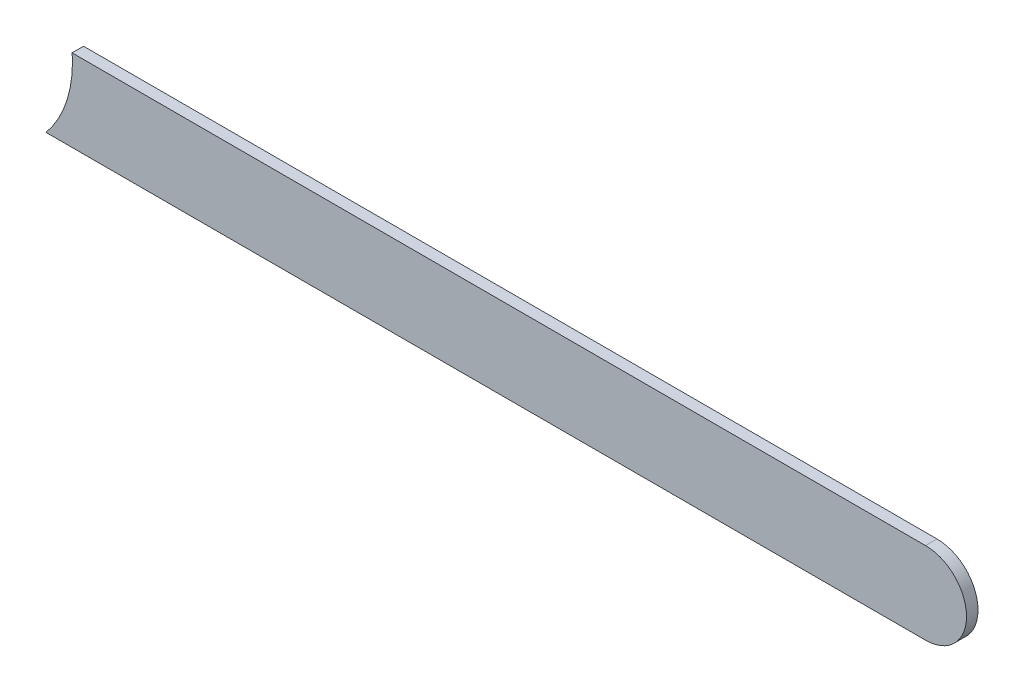
ISO-10303-21;
HEADER;
FILE_DESCRIPTION(('STEP AP214'),'2;1');
FILE_NAME('part.step','',(''),(''),'','','');
FILE_SCHEMA(('AUTOMOTIVE_DESIGN { 1 0 10303 214 1 1 1 1 }'));
ENDSEC;
DATA;
#1=APPLICATION_CONTEXT('core data for automotive mechanical design processes');
#2=APPLICATION_PROTOCOL_DEFINITION('international standard','automotive_design',2000,#1);
#3=PRODUCT_CONTEXT('',#1,'mechanical');
#4=PRODUCT('Part','Part','',(#3));
#5=PRODUCT_RELATED_PRODUCT_CATEGORY('part','',(#4));
#6=PRODUCT_DEFINITION_FORMATION('','',#4);
#7=PRODUCT_DEFINITION_CONTEXT('part definition',#1,'design');
#8=PRODUCT_DEFINITION('design','',#6,#7);
#9=PRODUCT_DEFINITION_SHAPE('','',#8);
#10=(LENGTH_UNIT() NAMED_UNIT(*) SI_UNIT(.MILLI.,.METRE.));
#11=(NAMED_UNIT(*) PLANE_ANGLE_UNIT() SI_UNIT($,.RADIAN.));
#12=(NAMED_UNIT(*) SI_UNIT($,.STERADIAN.) SOLID_ANGLE_UNIT());
#13=UNCERTAINTY_MEASURE_WITH_UNIT(LENGTH_MEASURE(1.E-05),#10,'distance_accuracy_value','');
#14=(GEOMETRIC_REPRESENTATION_CONTEXT(3) GLOBAL_UNCERTAINTY_ASSIGNED_CONTEXT((#13)) GLOBAL_UNIT_ASSIGNED_CONTEXT((#10,
#11,#12)) REPRESENTATION_CONTEXT('',''));
#15=CARTESIAN_POINT('',(0.,0.,0.));
#16=DIRECTION('',(0.,0.,1.));
#17=DIRECTION('',(1.,0.,0.));
#18=AXIS2_PLACEMENT_3D('',#15,#16,#17);
#19=CARTESIAN_POINT('',(87.6906923973138,72.15997252,0.));
#20=DIRECTION('',(0.,1.,0.));
#21=DIRECTION('',(1.,0.,0.));
#22=AXIS2_PLACEMENT_3D('',#19,#20,#21);
#23=PLANE('',#22);
#24=DIRECTION('',(1.,0.,0.));
#25=VECTOR('',#24,1.);
#26=CARTESIAN_POINT('',(87.51697254,72.15997252,0.03556));
#27=LINE('',#26,#25);
#28=CARTESIAN_POINT('',(87.6906923973138,72.15997252,0.03556));
#29=VERTEX_POINT('',#28);
#30=CARTESIAN_POINT('',(90.41697182,72.15997252,0.03556));
#31=VERTEX_POINT('',#30);
#32=EDGE_CURVE('E11',#29,#31,#27,.T.);
#33=ORIENTED_EDGE('',*,*,#32,.F.);
#34=DIRECTION('',(0.,0.,1.));
#35=VECTOR('',#34,1.);
#36=CARTESIAN_POINT('',(87.6906923973138,72.15997252,0.));
#37=LINE('',#36,#35);
#38=CARTESIAN_POINT('',(87.6906923973138,72.15997252,0.));
#39=VERTEX_POINT('',#38);
#40=EDGE_CURVE('E24',#39,#29,#37,.T.);
#41=ORIENTED_EDGE('',*,*,#40,.F.);
#42=DIRECTION('',(1.,0.,0.));
#43=VECTOR('',#42,1.);
#44=CARTESIAN_POINT('',(87.51697254,72.15997252,0.));
#45=LINE('',#44,#43);
#46=CARTESIAN_POINT('',(90.41697182,72.15997252,0.));
#47=VERTEX_POINT('',#46);
#48=EDGE_CURVE('E82',#39,#47,#45,.T.);
#49=ORIENTED_EDGE('',*,*,#48,.T.);
#50=DIRECTION('',(0.,0.,1.));
#51=VECTOR('',#50,1.);
#52=CARTESIAN_POINT('',(90.41697182,72.15997252,0.));
#53=LINE('',#52,#51);
#54=EDGE_CURVE('E37',#47,#31,#53,.T.);
#55=ORIENTED_EDGE('',*,*,#54,.T.);
#56=EDGE_LOOP('',(#33,#41,#49,#55));
#57=FACE_BOUND('',#56,.T.);
#58=ADVANCED_FACE('F17',(#57),#23,.F.);
#59=CARTESIAN_POINT('',(90.41697182,72.28697252,0.));
#60=DIRECTION('',(0.,0.,-1.));
#61=DIRECTION('',(1.1189649382048E-13,-1.,0.));
#62=AXIS2_PLACEMENT_3D('',#59,#60,#61);
#63=CYLINDRICAL_SURFACE('',#62,0.127000000000005);
#64=CARTESIAN_POINT('',(90.41697182,72.28697252,0.03556));
#65=DIRECTION('',(0.,0.,1.));
#66=DIRECTION('',(1.1189649382048E-13,-1.,0.));
#67=AXIS2_PLACEMENT_3D('',#64,#65,#66);
#68=CIRCLE('',#67,0.127000000000005);
#69=CARTESIAN_POINT('',(90.41697182,72.41397252,0.03556));
#70=VERTEX_POINT('',#69);
#71=EDGE_CURVE('E97',#31,#70,#68,.T.);
#72=ORIENTED_EDGE('',*,*,#71,.F.);
#73=ORIENTED_EDGE('',*,*,#54,.F.);
#74=CARTESIAN_POINT('',(90.41697182,72.28697252,0.));
#75=DIRECTION('',(0.,0.,1.));
#76=DIRECTION('',(1.1189649382048E-13,-1.,0.));
#77=AXIS2_PLACEMENT_3D('',#74,#75,#76);
#78=CIRCLE('',#77,0.127000000000005);
#79=CARTESIAN_POINT('',(90.41697182,72.41397252,0.));
#80=VERTEX_POINT('',#79);
#81=EDGE_CURVE('E94',#47,#80,#78,.T.);
#82=ORIENTED_EDGE('',*,*,#81,.T.);
#83=DIRECTION('',(0.,0.,1.));
#84=VECTOR('',#83,1.);
#85=CARTESIAN_POINT('',(90.41697182,72.41397252,0.));
#86=LINE('',#85,#84);
#87=EDGE_CURVE('E92',#80,#70,#86,.T.);
#88=ORIENTED_EDGE('',*,*,#87,.T.);
#89=EDGE_LOOP('',(#72,#73,#82,#88));
#90=FACE_BOUND('',#89,.T.);
#91=ADVANCED_FACE('F103',(#90),#63,.T.);
#92=CARTESIAN_POINT('',(90.41697182,72.41397252,0.));
#93=DIRECTION('',(0.,-1.,0.));
#94=DIRECTION('',(-1.,0.,0.));
#95=AXIS2_PLACEMENT_3D('',#92,#93,#94);
#96=PLANE('',#95);
#97=DIRECTION('',(-1.,0.,0.));
#98=VECTOR('',#97,1.);
#99=CARTESIAN_POINT('',(90.41697182,72.41397252,0.03556));
#100=LINE('',#99,#98);
#101=CARTESIAN_POINT('',(87.7715462150372,72.41397252,0.03556));
#102=VERTEX_POINT('',#101);
#103=EDGE_CURVE('E89',#70,#102,#100,.T.);
#104=ORIENTED_EDGE('',*,*,#103,.F.);
#105=ORIENTED_EDGE('',*,*,#87,.F.);
#106=DIRECTION('',(-1.,0.,0.));
#107=VECTOR('',#106,1.);
#108=CARTESIAN_POINT('',(90.41697182,72.41397252,0.));
#109=LINE('',#108,#107);
#110=CARTESIAN_POINT('',(87.7715462150372,72.41397252,0.));
#111=VERTEX_POINT('',#110);
#112=EDGE_CURVE('E87',#80,#111,#109,.T.);
#113=ORIENTED_EDGE('',*,*,#112,.T.);
#114=DIRECTION('',(0.,0.,1.));
#115=VECTOR('',#114,1.);
#116=CARTESIAN_POINT('',(87.7715462150372,72.41397252,0.));
#117=LINE('',#116,#115);
#118=EDGE_CURVE('E69',#111,#102,#117,.T.);
#119=ORIENTED_EDGE('',*,*,#118,.T.);
#120=EDGE_LOOP('',(#104,#105,#113,#119));
#121=FACE_BOUND('',#120,.T.);
#122=ADVANCED_FACE('F108',(#121),#96,.F.);
#123=CARTESIAN_POINT('',(87.41697274,72.38697232,0.));
#124=DIRECTION('',(0.,0.,-1.));
#125=DIRECTION('',(1.,0.,0.));
#126=AXIS2_PLACEMENT_3D('',#123,#124,#125);
#127=CYLINDRICAL_SURFACE('',#126,0.3556);
#128=DIRECTION('',(0.,0.,1.));
#129=VECTOR('',#128,1.);
#130=CARTESIAN_POINT('',(87.77257274,72.38697232,0.));
#131=LINE('',#130,#129);
#132=CARTESIAN_POINT('',(87.77257274,72.38697232,0.));
#133=VERTEX_POINT('',#132);
#134=CARTESIAN_POINT('',(87.77257274,72.38697232,0.03556));
#135=VERTEX_POINT('',#134);
#136=EDGE_CURVE('E59',#133,#135,#131,.T.);
#137=ORIENTED_EDGE('',*,*,#136,.T.);
#138=CARTESIAN_POINT('',(87.41697274,72.38697232,0.03556));
#139=DIRECTION('',(0.,0.,1.));
#140=DIRECTION('',(1.,0.,0.));
#141=AXIS2_PLACEMENT_3D('',#138,#139,#140);
#142=CIRCLE('',#141,0.3556);
#143=EDGE_CURVE('E70',#135,#102,#142,.T.);
#144=ORIENTED_EDGE('',*,*,#143,.T.);
#145=ORIENTED_EDGE('',*,*,#118,.F.);
#146=CARTESIAN_POINT('',(87.41697274,72.38697232,0.));
#147=DIRECTION('',(0.,0.,1.));
#148=DIRECTION('',(1.,0.,0.));
#149=AXIS2_PLACEMENT_3D('',#146,#147,#148);
#150=CIRCLE('',#149,0.3556);
#151=EDGE_CURVE('E73',#133,#111,#150,.T.);
#152=ORIENTED_EDGE('',*,*,#151,.F.);
#153=EDGE_LOOP('',(#137,#144,#145,#152));
#154=FACE_BOUND('',#153,.T.);
#155=ADVANCED_FACE('F74',(#154),#127,.F.);
#156=CARTESIAN_POINT('',(87.41697274,72.38697232,0.));
#157=DIRECTION('',(0.,0.,-1.));
#158=DIRECTION('',(1.,0.,0.));
#159=AXIS2_PLACEMENT_3D('',#156,#157,#158);
#160=CYLINDRICAL_SURFACE('',#159,0.3556);
#161=ORIENTED_EDGE('',*,*,#40,.T.);
#162=CARTESIAN_POINT('',(87.41697274,72.38697232,0.03556));
#163=DIRECTION('',(0.,0.,1.));
#164=DIRECTION('',(1.,0.,0.));
#165=AXIS2_PLACEMENT_3D('',#162,#163,#164);
#166=CIRCLE('',#165,0.3556);
#167=EDGE_CURVE('E65',#29,#135,#166,.T.);
#168=ORIENTED_EDGE('',*,*,#167,.T.);
#169=ORIENTED_EDGE('',*,*,#136,.F.);
#170=EDGE_CURVE('E63',#39,#133,#150,.T.);
#171=ORIENTED_EDGE('',*,*,#170,.F.);
#172=EDGE_LOOP('',(#161,#168,#169,#171));
#173=FACE_BOUND('',#172,.T.);
#174=ADVANCED_FACE('F61',(#173),#160,.F.);
#175=CARTESIAN_POINT('',(87.51697254,72.15997252,0.));
#176=DIRECTION('',(0.,0.,-1.));
#177=DIRECTION('',(-1.,0.,0.));
#178=AXIS2_PLACEMENT_3D('',#175,#176,#177);
#179=PLANE('',#178);
#180=ORIENTED_EDGE('',*,*,#48,.F.);
#181=ORIENTED_EDGE('',*,*,#170,.T.);
#182=ORIENTED_EDGE('',*,*,#151,.T.);
#183=ORIENTED_EDGE('',*,*,#112,.F.);
#184=ORIENTED_EDGE('',*,*,#81,.F.);
#185=EDGE_LOOP('',(#180,#181,#182,#183,#184));
#186=FACE_BOUND('',#185,.T.);
#187=ADVANCED_FACE('F80',(#186),#179,.T.);
#188=CARTESIAN_POINT('',(87.51697254,72.15997252,0.03556));
#189=DIRECTION('',(0.,0.,-1.));
#190=DIRECTION('',(-1.,0.,0.));
#191=AXIS2_PLACEMENT_3D('',#188,#189,#190);
#192=PLANE('',#191);
#193=ORIENTED_EDGE('',*,*,#167,.F.);
#194=ORIENTED_EDGE('',*,*,#32,.T.);
#195=ORIENTED_EDGE('',*,*,#71,.T.);
#196=ORIENTED_EDGE('',*,*,#103,.T.);
#197=ORIENTED_EDGE('',*,*,#143,.F.);
#198=EDGE_LOOP('',(#193,#194,#195,#196,#197));
#199=FACE_BOUND('',#198,.T.);
#200=ADVANCED_FACE('F106',(#199),#192,.F.);
#201=CLOSED_SHELL('',(#58,#91,#122,#155,#174,#187,#200));
#202=MANIFOLD_SOLID_BREP('B1',#201);
#203=ADVANCED_BREP_SHAPE_REPRESENTATION('',(#18,#202),#14);
#204=SHAPE_DEFINITION_REPRESENTATION(#9,#203);
ENDSEC;
END-ISO-10303-21;
